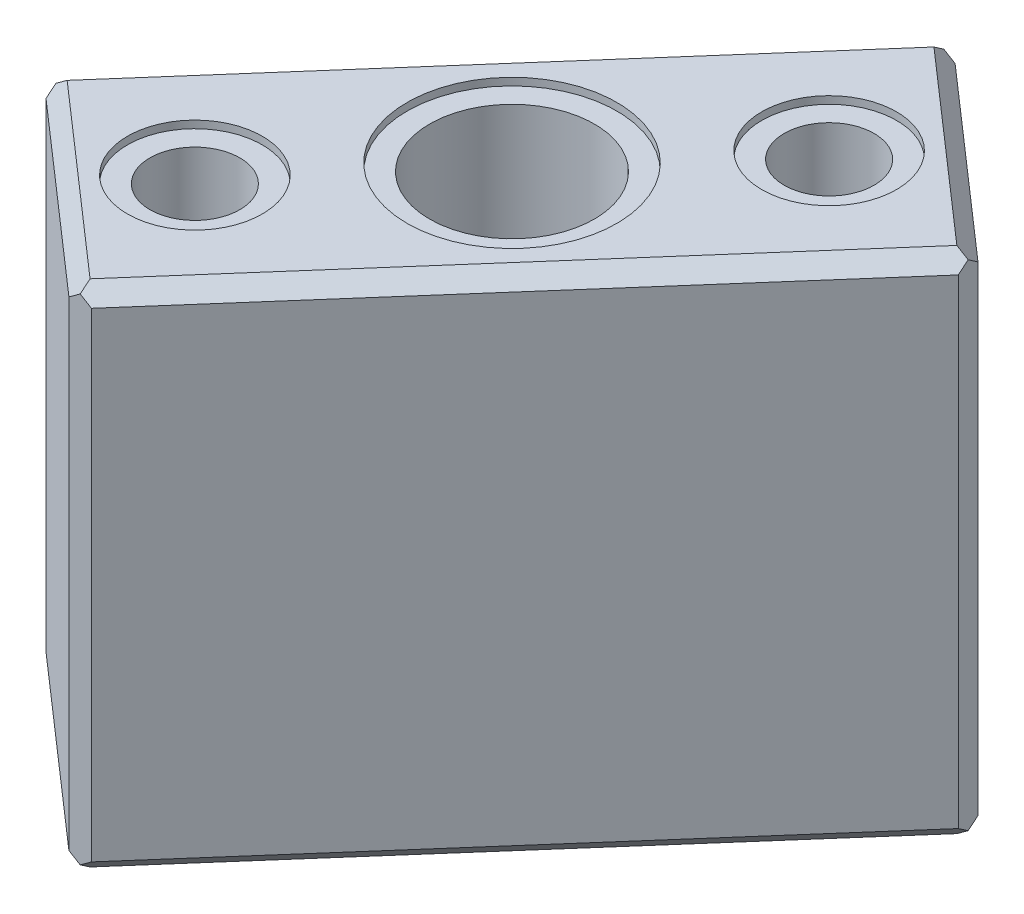
ISO-10303-21;
HEADER;
FILE_DESCRIPTION(('STEP AP214'),'2;1');
FILE_NAME('part.step','',(''),(''),'','','');
FILE_SCHEMA(('AUTOMOTIVE_DESIGN { 1 0 10303 214 1 1 1 1 }'));
ENDSEC;
DATA;
#1=APPLICATION_CONTEXT('core data for automotive mechanical design processes');
#2=APPLICATION_PROTOCOL_DEFINITION('international standard','automotive_design',2000,#1);
#3=PRODUCT_CONTEXT('',#1,'mechanical');
#4=PRODUCT('Part','Part','',(#3));
#5=PRODUCT_RELATED_PRODUCT_CATEGORY('part','',(#4));
#6=PRODUCT_DEFINITION_FORMATION('','',#4);
#7=PRODUCT_DEFINITION_CONTEXT('part definition',#1,'design');
#8=PRODUCT_DEFINITION('design','',#6,#7);
#9=PRODUCT_DEFINITION_SHAPE('','',#8);
#10=(LENGTH_UNIT() NAMED_UNIT(*) SI_UNIT(.MILLI.,.METRE.));
#11=(NAMED_UNIT(*) PLANE_ANGLE_UNIT() SI_UNIT($,.RADIAN.));
#12=(NAMED_UNIT(*) SI_UNIT($,.STERADIAN.) SOLID_ANGLE_UNIT());
#13=UNCERTAINTY_MEASURE_WITH_UNIT(LENGTH_MEASURE(1.E-05),#10,'distance_accuracy_value','');
#14=(GEOMETRIC_REPRESENTATION_CONTEXT(3) GLOBAL_UNCERTAINTY_ASSIGNED_CONTEXT((#13)) GLOBAL_UNIT_ASSIGNED_CONTEXT((#10,
#11,#12)) REPRESENTATION_CONTEXT('',''));
#15=CARTESIAN_POINT('',(0.,0.,0.));
#16=DIRECTION('',(0.,0.,1.));
#17=DIRECTION('',(1.,0.,0.));
#18=AXIS2_PLACEMENT_3D('',#15,#16,#17);
#19=CARTESIAN_POINT('',(-110.30475898659,-18.4999999999996,92.6101585459169));
#20=DIRECTION('',(0.,-1.,0.));
#21=DIRECTION('',(-0.625050923025958,0.,0.780583976023335));
#22=AXIS2_PLACEMENT_3D('',#19,#20,#21);
#23=PLANE('',#22);
#24=DIRECTION('',(0.658504607868521,0.,-0.752576694706875));
#25=VECTOR('',#24,1.);
#26=CARTESIAN_POINT('',(-108.909249657567,-18.4999999999996,93.8312292088123));
#27=LINE('',#26,#25);
#28=CARTESIAN_POINT('',(-125.536491006247,-18.4999999999995,112.833790750161));
#29=VERTEX_POINT('',#28);
#30=CARTESIAN_POINT('',(-112.037146544942,-18.4999999999996,97.4059685086701));
#31=VERTEX_POINT('',#30);
#32=EDGE_CURVE('E326',#29,#31,#27,.T.);
#33=ORIENTED_EDGE('',*,*,#32,.T.);
#34=DIRECTION('',(0.752576694706874,0.,0.658504607868522));
#35=VECTOR('',#34,1.);
#36=CARTESIAN_POINT('',(-113.432655873965,-18.4999999999996,96.1848978457747));
#37=LINE('',#36,#35);
#38=CARTESIAN_POINT('',(-105.919568803513,-18.4999999999996,102.758849032421));
#39=VERTEX_POINT('',#38);
#40=EDGE_CURVE('E329',#31,#39,#37,.T.);
#41=ORIENTED_EDGE('',*,*,#40,.T.);
#42=DIRECTION('',(-0.658504607868522,0.,0.752576694706875));
#43=VECTOR('',#42,1.);
#44=CARTESIAN_POINT('',(-102.791671916137,-18.4999999999996,99.1841097325633));
#45=LINE('',#44,#43);
#46=CARTESIAN_POINT('',(-119.418913264817,-18.4999999999995,118.186671273912));
#47=VERTEX_POINT('',#46);
#48=EDGE_CURVE('E287',#39,#47,#45,.T.);
#49=ORIENTED_EDGE('',*,*,#48,.T.);
#50=DIRECTION('',(-0.752576694706874,0.,-0.658504607868522));
#51=VECTOR('',#50,1.);
#52=CARTESIAN_POINT('',(-126.93200033527,-18.4999999999995,111.612720087266));
#53=LINE('',#52,#51);
#54=EDGE_CURVE('E323',#47,#29,#53,.T.);
#55=ORIENTED_EDGE('',*,*,#54,.T.);
#56=EDGE_LOOP('',(#33,#41,#49,#55));
#57=FACE_BOUND('',#56,.T.);
#58=ADVANCED_FACE('F158',(#57),#23,.T.);
#59=CARTESIAN_POINT('',(0.,-1.5,0.));
#60=DIRECTION('',(0.,1.,0.));
#61=DIRECTION('',(0.,0.,1.));
#62=AXIS2_PLACEMENT_3D('',#59,#60,#61);
#63=PLANE('',#62);
#64=CARTESIAN_POINT('',(-115.72802990488,-1.5,107.796319891291));
#65=DIRECTION('',(0.,1.,0.));
#66=DIRECTION('',(0.,0.,1.));
#67=AXIS2_PLACEMENT_3D('',#64,#65,#66);
#68=CIRCLE('',#67,3.50000000000001);
#69=CARTESIAN_POINT('',(-115.72802990488,-1.5,111.296319891291));
#70=VERTEX_POINT('',#69);
#71=EDGE_CURVE('E449',#70,#70,#68,.T.);
#72=ORIENTED_EDGE('',*,*,#71,.F.);
#73=EDGE_LOOP('',(#72));
#74=FACE_BOUND('',#73,.T.);
#75=CARTESIAN_POINT('',(-120.666814463894,-1.5,113.440645101593));
#76=DIRECTION('',(0.,1.,0.));
#77=DIRECTION('',(0.,0.,1.));
#78=AXIS2_PLACEMENT_3D('',#75,#76,#77);
#79=CIRCLE('',#78,2.25);
#80=CARTESIAN_POINT('',(-120.666814463894,-1.5,115.690645101593));
#81=VERTEX_POINT('',#80);
#82=EDGE_CURVE('E436',#81,#81,#79,.T.);
#83=ORIENTED_EDGE('',*,*,#82,.F.);
#84=EDGE_LOOP('',(#83));
#85=FACE_BOUND('',#84,.T.);
#86=CARTESIAN_POINT('',(-110.789245345866,-1.5,102.151994680989));
#87=DIRECTION('',(0.,1.,0.));
#88=DIRECTION('',(0.,0.,1.));
#89=AXIS2_PLACEMENT_3D('',#86,#87,#88);
#90=CIRCLE('',#89,2.25);
#91=CARTESIAN_POINT('',(-110.789245345866,-1.5,104.401994680989));
#92=VERTEX_POINT('',#91);
#93=EDGE_CURVE('E457',#92,#92,#90,.T.);
#94=ORIENTED_EDGE('',*,*,#93,.F.);
#95=EDGE_LOOP('',(#94));
#96=FACE_BOUND('',#95,.T.);
#97=DIRECTION('',(0.658504607868522,0.,-0.752576694706875));
#98=VECTOR('',#97,1.);
#99=CARTESIAN_POINT('',(-9.06510493459425,-1.5,-7.93196681777005));
#100=LINE('',#99,#98);
#101=CARTESIAN_POINT('',(-119.418913264817,-1.5,118.186671273912));
#102=VERTEX_POINT('',#101);
#103=CARTESIAN_POINT('',(-105.919568803513,-1.5,102.758849032421));
#104=VERTEX_POINT('',#103);
#105=EDGE_CURVE('E387',#102,#104,#100,.T.);
#106=ORIENTED_EDGE('',*,*,#105,.T.);
#107=DIRECTION('',(-0.752576694706874,0.,-0.658504607868522));
#108=VECTOR('',#107,1.);
#109=CARTESIAN_POINT('',(-96.8544638689183,-1.5,110.690815850191));
#110=LINE('',#109,#108);
#111=CARTESIAN_POINT('',(-112.037146544942,-1.5,97.4059685086701));
#112=VERTEX_POINT('',#111);
#113=EDGE_CURVE('E126',#104,#112,#110,.T.);
#114=ORIENTED_EDGE('',*,*,#113,.T.);
#115=DIRECTION('',(-0.658504607868521,0.,0.752576694706875));
#116=VECTOR('',#115,1.);
#117=CARTESIAN_POINT('',(-15.182682676024,-1.5,-13.2848473415211));
#118=LINE('',#117,#116);
#119=CARTESIAN_POINT('',(-125.536491006247,-1.5,112.833790750161));
#120=VERTEX_POINT('',#119);
#121=EDGE_CURVE('E169',#112,#120,#118,.T.);
#122=ORIENTED_EDGE('',*,*,#121,.T.);
#123=DIRECTION('',(0.752576694706874,0.,0.658504607868522));
#124=VECTOR('',#123,1.);
#125=CARTESIAN_POINT('',(-110.353808330223,-1.5,126.118638091682));
#126=LINE('',#125,#124);
#127=EDGE_CURVE('E390',#120,#102,#126,.T.);
#128=ORIENTED_EDGE('',*,*,#127,.T.);
#129=EDGE_LOOP('',(#106,#114,#122,#128));
#130=FACE_BOUND('',#129,.T.);
#131=ADVANCED_FACE('F531',(#74,#85,#96,#130),#63,.T.);
#132=CARTESIAN_POINT('',(-110.683060634157,-50.5720822243419,126.494926439035));
#133=DIRECTION('',(-0.658504607868522,0.,0.752576694706874));
#134=DIRECTION('',(0.752576694706874,0.,0.658504607868522));
#135=AXIS2_PLACEMENT_3D('',#132,#133,#134);
#136=PLANE('',#135);
#137=DIRECTION('',(0.,-1.,0.));
#138=VECTOR('',#137,1.);
#139=CARTESIAN_POINT('',(-125.865743310181,-50.5720822243419,113.210079097514));
#140=LINE('',#139,#138);
#141=CARTESIAN_POINT('',(-125.865743310181,-1.99999999999999,113.210079097514));
#142=VERTEX_POINT('',#141);
#143=CARTESIAN_POINT('',(-125.865743310181,-17.9999999999995,113.210079097514));
#144=VERTEX_POINT('',#143);
#145=EDGE_CURVE('E409',#142,#144,#140,.T.);
#146=ORIENTED_EDGE('',*,*,#145,.T.);
#147=DIRECTION('',(0.752576694706874,0.,0.658504607868522));
#148=VECTOR('',#147,1.);
#149=CARTESIAN_POINT('',(-110.683060634157,-17.9999999999995,126.494926439035));
#150=LINE('',#149,#148);
#151=CARTESIAN_POINT('',(-119.748165568751,-17.9999999999995,118.562959621265));
#152=VERTEX_POINT('',#151);
#153=EDGE_CURVE('E366',#144,#152,#150,.T.);
#154=ORIENTED_EDGE('',*,*,#153,.T.);
#155=DIRECTION('',(0.,1.,0.));
#156=VECTOR('',#155,1.);
#157=CARTESIAN_POINT('',(-119.748165568751,-50.5720822243419,118.562959621265));
#158=LINE('',#157,#156);
#159=CARTESIAN_POINT('',(-119.748165568751,-1.99999999999999,118.562959621265));
#160=VERTEX_POINT('',#159);
#161=EDGE_CURVE('E470',#152,#160,#158,.T.);
#162=ORIENTED_EDGE('',*,*,#161,.T.);
#163=DIRECTION('',(-0.752576694706874,0.,-0.658504607868522));
#164=VECTOR('',#163,1.);
#165=CARTESIAN_POINT('',(-110.683060634157,-1.99999999999999,126.494926439035));
#166=LINE('',#165,#164);
#167=EDGE_CURVE('E363',#160,#142,#166,.T.);
#168=ORIENTED_EDGE('',*,*,#167,.T.);
#169=EDGE_LOOP('',(#146,#154,#162,#168));
#170=FACE_BOUND('',#169,.T.);
#171=ADVANCED_FACE('F515',(#170),#136,.T.);
#172=CARTESIAN_POINT('',(-8.68881658724085,-50.5720822243419,-7.60271451383582));
#173=DIRECTION('',(0.752576694706874,0.,0.658504607868522));
#174=DIRECTION('',(0.658504607868522,0.,-0.752576694706875));
#175=AXIS2_PLACEMENT_3D('',#172,#173,#174);
#176=PLANE('',#175);
#177=DIRECTION('',(0.,-1.,0.));
#178=VECTOR('',#177,1.);
#179=CARTESIAN_POINT('',(-119.042624917464,-50.5720822243419,118.515923577846));
#180=LINE('',#179,#178);
#181=CARTESIAN_POINT('',(-119.042624917464,-1.99999999999996,118.515923577846));
#182=VERTEX_POINT('',#181);
#183=CARTESIAN_POINT('',(-119.042624917464,-17.9999999999996,118.515923577846));
#184=VERTEX_POINT('',#183);
#185=EDGE_CURVE('E478',#182,#184,#180,.T.);
#186=ORIENTED_EDGE('',*,*,#185,.T.);
#187=DIRECTION('',(0.658504607868522,0.,-0.752576694706875));
#188=VECTOR('',#187,1.);
#189=CARTESIAN_POINT('',(-8.68881658724077,-18.0000000000001,-7.6027145138359));
#190=LINE('',#189,#188);
#191=CARTESIAN_POINT('',(-105.543280456159,-17.9999999999996,103.088101336355));
#192=VERTEX_POINT('',#191);
#193=EDGE_CURVE('E384',#184,#192,#190,.T.);
#194=ORIENTED_EDGE('',*,*,#193,.T.);
#195=DIRECTION('',(0.,1.,0.));
#196=VECTOR('',#195,1.);
#197=CARTESIAN_POINT('',(-105.543280456159,-50.5720822243419,103.088101336355));
#198=LINE('',#197,#196);
#199=CARTESIAN_POINT('',(-105.543280456159,-1.99999999999996,103.088101336355));
#200=VERTEX_POINT('',#199);
#201=EDGE_CURVE('E474',#192,#200,#198,.T.);
#202=ORIENTED_EDGE('',*,*,#201,.T.);
#203=DIRECTION('',(-0.658504607868522,0.,0.752576694706875));
#204=VECTOR('',#203,1.);
#205=CARTESIAN_POINT('',(-8.68881658724085,-1.99999999999996,-7.60271451383582));
#206=LINE('',#205,#204);
#207=EDGE_CURVE('E381',#200,#182,#206,.T.);
#208=ORIENTED_EDGE('',*,*,#207,.T.);
#209=EDGE_LOOP('',(#186,#194,#202,#208));
#210=FACE_BOUND('',#209,.T.);
#211=ADVANCED_FACE('F546',(#210),#176,.T.);
#212=CARTESIAN_POINT('',(-96.525211564984,-50.5720822243419,110.314527502838));
#213=DIRECTION('',(0.658504607868522,0.,-0.752576694706874));
#214=DIRECTION('',(-0.752576694706874,0.,-0.658504607868522));
#215=AXIS2_PLACEMENT_3D('',#212,#213,#214);
#216=PLANE('',#215);
#217=DIRECTION('',(0.,-1.,0.));
#218=VECTOR('',#217,1.);
#219=CARTESIAN_POINT('',(-105.590316499578,-50.5720822243419,102.382560685068));
#220=LINE('',#219,#218);
#221=CARTESIAN_POINT('',(-105.590316499578,-1.99999999999999,102.382560685068));
#222=VERTEX_POINT('',#221);
#223=CARTESIAN_POINT('',(-105.590316499578,-17.9999999999996,102.382560685068));
#224=VERTEX_POINT('',#223);
#225=EDGE_CURVE('E298',#222,#224,#220,.T.);
#226=ORIENTED_EDGE('',*,*,#225,.T.);
#227=DIRECTION('',(-0.752576694706874,0.,-0.658504607868522));
#228=VECTOR('',#227,1.);
#229=CARTESIAN_POINT('',(-96.525211564984,-17.9999999999996,110.314527502838));
#230=LINE('',#229,#228);
#231=CARTESIAN_POINT('',(-111.707894241008,-17.9999999999996,97.0296801613166));
#232=VERTEX_POINT('',#231);
#233=EDGE_CURVE('E279',#224,#232,#230,.T.);
#234=ORIENTED_EDGE('',*,*,#233,.T.);
#235=DIRECTION('',(0.,1.,0.));
#236=VECTOR('',#235,1.);
#237=CARTESIAN_POINT('',(-111.707894241008,-50.5720822243419,97.0296801613166));
#238=LINE('',#237,#236);
#239=CARTESIAN_POINT('',(-111.707894241008,-1.99999999999999,97.0296801613166));
#240=VERTEX_POINT('',#239);
#241=EDGE_CURVE('E295',#232,#240,#238,.T.);
#242=ORIENTED_EDGE('',*,*,#241,.T.);
#243=DIRECTION('',(0.752576694706874,0.,0.658504607868522));
#244=VECTOR('',#243,1.);
#245=CARTESIAN_POINT('',(-96.525211564984,-1.99999999999999,110.314527502838));
#246=LINE('',#245,#244);
#247=EDGE_CURVE('E301',#240,#222,#246,.T.);
#248=ORIENTED_EDGE('',*,*,#247,.T.);
#249=EDGE_LOOP('',(#226,#234,#242,#248));
#250=FACE_BOUND('',#249,.T.);
#251=ADVANCED_FACE('F293',(#250),#216,.T.);
#252=CARTESIAN_POINT('',(-15.5589710233774,-50.5720822243419,-13.6140996454554));
#253=DIRECTION('',(-0.752576694706875,0.,-0.658504607868521));
#254=DIRECTION('',(-0.658504607868521,0.,0.752576694706875));
#255=AXIS2_PLACEMENT_3D('',#252,#253,#254);
#256=PLANE('',#255);
#257=DIRECTION('',(0.,-1.,0.));
#258=VECTOR('',#257,1.);
#259=CARTESIAN_POINT('',(-112.413434892296,-50.5720822243419,97.0767162047358));
#260=LINE('',#259,#258);
#261=CARTESIAN_POINT('',(-112.413434892296,-1.99999999999998,97.0767162047358));
#262=VERTEX_POINT('',#261);
#263=CARTESIAN_POINT('',(-112.413434892296,-17.9999999999996,97.0767162047358));
#264=VERTEX_POINT('',#263);
#265=EDGE_CURVE('E482',#262,#264,#260,.T.);
#266=ORIENTED_EDGE('',*,*,#265,.T.);
#267=DIRECTION('',(-0.658504607868521,0.,0.752576694706875));
#268=VECTOR('',#267,1.);
#269=CARTESIAN_POINT('',(-15.5589710233773,-18.0000000000001,-13.6140996454554));
#270=LINE('',#269,#268);
#271=CARTESIAN_POINT('',(-125.9127793536,-17.9999999999996,112.504538446227));
#272=VERTEX_POINT('',#271);
#273=EDGE_CURVE('E348',#264,#272,#270,.T.);
#274=ORIENTED_EDGE('',*,*,#273,.T.);
#275=DIRECTION('',(0.,1.,0.));
#276=VECTOR('',#275,1.);
#277=CARTESIAN_POINT('',(-125.9127793536,-50.5720822243419,112.504538446227));
#278=LINE('',#277,#276);
#279=CARTESIAN_POINT('',(-125.9127793536,-1.99999999999998,112.504538446227));
#280=VERTEX_POINT('',#279);
#281=EDGE_CURVE('E311',#272,#280,#278,.T.);
#282=ORIENTED_EDGE('',*,*,#281,.T.);
#283=DIRECTION('',(0.658504607868521,0.,-0.752576694706875));
#284=VECTOR('',#283,1.);
#285=CARTESIAN_POINT('',(-15.5589710233774,-1.99999999999998,-13.6140996454554));
#286=LINE('',#285,#284);
#287=EDGE_CURVE('E345',#280,#262,#286,.T.);
#288=ORIENTED_EDGE('',*,*,#287,.T.);
#289=EDGE_LOOP('',(#266,#274,#282,#288));
#290=FACE_BOUND('',#289,.T.);
#291=ADVANCED_FACE('F491',(#290),#256,.T.);
#292=CARTESIAN_POINT('',(-119.748165568751,-50.5720822243419,118.562959621265));
#293=DIRECTION('',(-0.0665190105238208,0.,-0.997785157856606));
#294=DIRECTION('',(0.,1.,0.));
#295=AXIS2_PLACEMENT_3D('',#292,#293,#294);
#296=PLANE('',#295);
#297=ORIENTED_EDGE('',*,*,#161,.F.);
#298=DIRECTION('',(0.814688169890332,-0.577350269189651,-0.0543125446593939));
#299=VECTOR('',#298,1.);
#300=CARTESIAN_POINT('',(-104.427546831179,-28.8573607414479,117.54158503876));
#301=LINE('',#300,#299);
#302=CARTESIAN_POINT('',(-119.395395243108,-18.2499999999995,118.539441599556));
#303=VERTEX_POINT('',#302);
#304=EDGE_CURVE('E378',#152,#303,#301,.T.);
#305=ORIENTED_EDGE('',*,*,#304,.T.);
#306=DIRECTION('',(0.814688169890375,0.57735026918959,-0.0543125446593968));
#307=VECTOR('',#306,1.);
#308=CARTESIAN_POINT('',(-134.833604089228,-29.190694074779,119.568655522631));
#309=LINE('',#308,#307);
#310=EDGE_CURVE('E375',#303,#184,#309,.T.);
#311=ORIENTED_EDGE('',*,*,#310,.T.);
#312=ORIENTED_EDGE('',*,*,#185,.F.);
#313=DIRECTION('',(-0.814688169890364,0.577350269189606,0.054312544659396));
#314=VECTOR('',#313,1.);
#315=CARTESIAN_POINT('',(-96.6665996670149,-17.8573607414462,117.024188561149));
#316=LINE('',#315,#314);
#317=CARTESIAN_POINT('',(-119.395395243108,-1.74999999999998,118.539441599556));
#318=VERTEX_POINT('',#317);
#319=EDGE_CURVE('E369',#182,#318,#316,.T.);
#320=ORIENTED_EDGE('',*,*,#319,.T.);
#321=DIRECTION('',(-0.814688169890336,-0.577350269189646,0.0543125446593942));
#322=VECTOR('',#321,1.);
#323=CARTESIAN_POINT('',(-142.594551253393,-18.1906940747818,120.086052000243));
#324=LINE('',#323,#322);
#325=EDGE_CURVE('E372',#318,#160,#324,.T.);
#326=ORIENTED_EDGE('',*,*,#325,.T.);
#327=EDGE_LOOP('',(#297,#305,#311,#312,#320,#326));
#328=FACE_BOUND('',#327,.T.);
#329=ADVANCED_FACE('F518',(#328),#296,.F.);
#330=CARTESIAN_POINT('',(-125.9127793536,-50.5720822243419,112.504538446227));
#331=DIRECTION('',(0.997785157856611,0.,-0.0665190105237388));
#332=DIRECTION('',(0.,1.,0.));
#333=AXIS2_PLACEMENT_3D('',#330,#331,#332);
#334=PLANE('',#333);
#335=ORIENTED_EDGE('',*,*,#281,.F.);
#336=DIRECTION('',(0.0543125446593289,-0.577350269189609,0.814688169890366));
#337=VECTOR('',#336,1.);
#338=CARTESIAN_POINT('',(-124.891404771096,-28.8573607414464,127.825157183799));
#339=LINE('',#338,#337);
#340=CARTESIAN_POINT('',(-125.889261331891,-18.2499999999995,112.857308771871));
#341=VERTEX_POINT('',#340);
#342=EDGE_CURVE('E360',#272,#341,#339,.T.);
#343=ORIENTED_EDGE('',*,*,#342,.T.);
#344=DIRECTION('',(0.0543125446593273,0.577350269189643,0.814688169890343));
#345=VECTOR('',#344,1.);
#346=CARTESIAN_POINT('',(-126.918475254965,-29.190694074781,97.4190999257498));
#347=LINE('',#346,#345);
#348=EDGE_CURVE('E357',#341,#144,#347,.T.);
#349=ORIENTED_EDGE('',*,*,#348,.T.);
#350=ORIENTED_EDGE('',*,*,#145,.F.);
#351=DIRECTION('',(-0.0543125446593276,0.577350269189637,-0.814688169890346));
#352=VECTOR('',#351,1.);
#353=CARTESIAN_POINT('',(-124.374008293485,-17.8573607414479,135.586104347964));
#354=LINE('',#353,#352);
#355=CARTESIAN_POINT('',(-125.889261331891,-1.74999999999999,112.857308771871));
#356=VERTEX_POINT('',#355);
#357=EDGE_CURVE('E351',#142,#356,#354,.T.);
#358=ORIENTED_EDGE('',*,*,#357,.T.);
#359=DIRECTION('',(-0.0543125446593281,-0.577350269189626,-0.814688169890355));
#360=VECTOR('',#359,1.);
#361=CARTESIAN_POINT('',(-127.435871732576,-18.1906940747806,89.6581527615855));
#362=LINE('',#361,#360);
#363=EDGE_CURVE('E354',#356,#280,#362,.T.);
#364=ORIENTED_EDGE('',*,*,#363,.T.);
#365=EDGE_LOOP('',(#335,#343,#349,#350,#358,#364));
#366=FACE_BOUND('',#365,.T.);
#367=ADVANCED_FACE('F505',(#366),#334,.F.);
#368=CARTESIAN_POINT('',(-111.707894241008,-50.5720822243419,97.0296801613166));
#369=DIRECTION('',(0.0665190105238026,0.,0.997785157856607));
#370=DIRECTION('',(0.,1.,0.));
#371=AXIS2_PLACEMENT_3D('',#368,#369,#370);
#372=PLANE('',#371);
#373=ORIENTED_EDGE('',*,*,#241,.F.);
#374=DIRECTION('',(-0.81468816989034,-0.577350269189642,0.0543125446593795));
#375=VECTOR('',#374,1.);
#376=CARTESIAN_POINT('',(-127.028512978581,-28.8573607414476,98.051054743822));
#377=LINE('',#376,#375);
#378=CARTESIAN_POINT('',(-112.060664566652,-18.2499999999996,97.0531981830262));
#379=VERTEX_POINT('',#378);
#380=EDGE_CURVE('E275',#232,#379,#377,.T.);
#381=ORIENTED_EDGE('',*,*,#380,.T.);
#382=DIRECTION('',(-0.814688169890362,0.577350269189611,0.054312544659381));
#383=VECTOR('',#382,1.);
#384=CARTESIAN_POINT('',(-96.6224557205314,-29.1906940747798,96.0239842599511));
#385=LINE('',#384,#383);
#386=EDGE_CURVE('E288',#379,#264,#385,.T.);
#387=ORIENTED_EDGE('',*,*,#386,.T.);
#388=ORIENTED_EDGE('',*,*,#265,.F.);
#389=DIRECTION('',(0.814688169890352,0.577350269189625,-0.0543125446593803));
#390=VECTOR('',#389,1.);
#391=CARTESIAN_POINT('',(-134.789460142745,-17.8573607414472,98.5684512214331));
#392=LINE('',#391,#390);
#393=CARTESIAN_POINT('',(-112.060664566652,-1.75000000000002,97.0531981830262));
#394=VERTEX_POINT('',#393);
#395=EDGE_CURVE('E300',#262,#394,#392,.T.);
#396=ORIENTED_EDGE('',*,*,#395,.T.);
#397=DIRECTION('',(0.814688169890353,-0.577350269189622,-0.0543125446593805));
#398=VECTOR('',#397,1.);
#399=CARTESIAN_POINT('',(-88.8615085563668,-18.1906940747804,95.5065877823399));
#400=LINE('',#399,#398);
#401=EDGE_CURVE('E304',#394,#240,#400,.T.);
#402=ORIENTED_EDGE('',*,*,#401,.T.);
#403=EDGE_LOOP('',(#373,#381,#387,#388,#396,#402));
#404=FACE_BOUND('',#403,.T.);
#405=ADVANCED_FACE('F303',(#404),#372,.F.);
#406=CARTESIAN_POINT('',(-105.543280456159,-50.5720822243419,103.088101336355));
#407=DIRECTION('',(-0.997785157856607,0.,0.0665190105238));
#408=DIRECTION('',(0.,1.,0.));
#409=AXIS2_PLACEMENT_3D('',#406,#407,#408);
#410=PLANE('',#409);
#411=DIRECTION('',(-0.0543125446593782,-0.577350269189625,-0.814688169890352));
#412=VECTOR('',#411,1.);
#413=CARTESIAN_POINT('',(-106.564655038664,-28.857360741447,87.7674825987828));
#414=LINE('',#413,#412);
#415=CARTESIAN_POINT('',(-105.566798477869,-18.2499999999996,102.735331010712));
#416=VERTEX_POINT('',#415);
#417=EDGE_CURVE('E339',#192,#416,#414,.T.);
#418=ORIENTED_EDGE('',*,*,#417,.T.);
#419=DIRECTION('',(-0.0543125446593786,0.577350269189616,-0.814688169890358));
#420=VECTOR('',#419,1.);
#421=CARTESIAN_POINT('',(-104.537584554794,-29.19069407478,118.173539856832));
#422=LINE('',#421,#420);
#423=EDGE_CURVE('E342',#416,#224,#422,.T.);
#424=ORIENTED_EDGE('',*,*,#423,.T.);
#425=ORIENTED_EDGE('',*,*,#225,.F.);
#426=DIRECTION('',(0.0543125446593794,0.577350269189597,0.814688169890372));
#427=VECTOR('',#426,1.);
#428=CARTESIAN_POINT('',(-107.082051516275,-17.8573607414457,80.0065354346188));
#429=LINE('',#428,#427);
#430=CARTESIAN_POINT('',(-105.566798477869,-1.75,102.735331010711));
#431=VERTEX_POINT('',#430);
#432=EDGE_CURVE('E336',#222,#431,#429,.T.);
#433=ORIENTED_EDGE('',*,*,#432,.T.);
#434=DIRECTION('',(0.0543125446593775,-0.577350269189638,0.814688169890342));
#435=VECTOR('',#434,1.);
#436=CARTESIAN_POINT('',(-104.020188077182,-18.1906940747813,125.934487020997));
#437=LINE('',#436,#435);
#438=EDGE_CURVE('E333',#431,#200,#437,.T.);
#439=ORIENTED_EDGE('',*,*,#438,.T.);
#440=ORIENTED_EDGE('',*,*,#201,.F.);
#441=EDGE_LOOP('',(#418,#424,#425,#433,#439,#440));
#442=FACE_BOUND('',#441,.T.);
#443=ADVANCED_FACE('F535',(#442),#410,.F.);
#444=CARTESIAN_POINT('',(-110.683060634157,-17.9999999999995,126.494926439035));
#445=DIRECTION('',(0.465633073666424,0.707106781186543,-0.532152084190193));
#446=DIRECTION('',(0.752576694706874,0.,0.658504607868522));
#447=AXIS2_PLACEMENT_3D('',#444,#445,#446);
#448=PLANE('',#447);
#449=DIRECTION('',(-0.814688169890352,0.577350269189628,0.0543125446593445));
#450=VECTOR('',#449,1.);
#451=CARTESIAN_POINT('',(-47.1827026331376,-74.02747969242,107.610204858622));
#452=LINE('',#451,#450);
#453=EDGE_CURVE('E401',#29,#341,#452,.T.);
#454=ORIENTED_EDGE('',*,*,#453,.F.);
#455=ORIENTED_EDGE('',*,*,#54,.F.);
#456=DIRECTION('',(0.0543125446593722,0.577350269189622,0.814688169890354));
#457=VECTOR('',#456,1.);
#458=CARTESIAN_POINT('',(-119.00984319693,-14.1515255307295,124.322722292225));
#459=LINE('',#458,#457);
#460=EDGE_CURVE('E405',#303,#47,#459,.F.);
#461=ORIENTED_EDGE('',*,*,#460,.F.);
#462=ORIENTED_EDGE('',*,*,#304,.F.);
#463=ORIENTED_EDGE('',*,*,#153,.F.);
#464=ORIENTED_EDGE('',*,*,#348,.F.);
#465=EDGE_LOOP('',(#454,#455,#461,#462,#463,#464));
#466=FACE_BOUND('',#465,.T.);
#467=ADVANCED_FACE('F509',(#466),#448,.F.);
#468=CARTESIAN_POINT('',(-8.68881658724077,-18.0000000000001,-7.6027145138359));
#469=DIRECTION('',(-0.532152084190178,0.707106781186561,-0.465633073666413));
#470=DIRECTION('',(0.658504607868522,0.,-0.752576694706875));
#471=AXIS2_PLACEMENT_3D('',#468,#469,#470);
#472=PLANE('',#471);
#473=ORIENTED_EDGE('',*,*,#460,.T.);
#474=ORIENTED_EDGE('',*,*,#48,.F.);
#475=DIRECTION('',(0.814688169890359,0.57735026918962,-0.0543125446593333));
#476=VECTOR('',#475,1.);
#477=CARTESIAN_POINT('',(-36.2674484629519,30.8608130257529,98.1153743430524));
#478=LINE('',#477,#476);
#479=EDGE_CURVE('E397',#416,#39,#478,.F.);
#480=ORIENTED_EDGE('',*,*,#479,.F.);
#481=ORIENTED_EDGE('',*,*,#417,.F.);
#482=ORIENTED_EDGE('',*,*,#193,.F.);
#483=ORIENTED_EDGE('',*,*,#310,.F.);
#484=EDGE_LOOP('',(#473,#474,#480,#481,#482,#483));
#485=FACE_BOUND('',#484,.T.);
#486=ADVANCED_FACE('F541',(#485),#472,.F.);
#487=CARTESIAN_POINT('',(-15.5589710233773,-18.0000000000001,-13.6140996454554));
#488=DIRECTION('',(0.532152084190188,0.707106781186551,0.465633073666416));
#489=DIRECTION('',(-0.658504607868521,0.,0.752576694706875));
#490=AXIS2_PLACEMENT_3D('',#487,#488,#489);
#491=PLANE('',#490);
#492=ORIENTED_EDGE('',*,*,#273,.F.);
#493=ORIENTED_EDGE('',*,*,#386,.F.);
#494=DIRECTION('',(-0.0543125446593611,0.577350269189624,-0.814688169890353));
#495=VECTOR('',#494,1.);
#496=CARTESIAN_POINT('',(-111.435892129054,-24.8914221114419,106.424784746993));
#497=LINE('',#496,#495);
#498=EDGE_CURVE('E282',#31,#379,#497,.T.);
#499=ORIENTED_EDGE('',*,*,#498,.F.);
#500=ORIENTED_EDGE('',*,*,#32,.F.);
#501=ORIENTED_EDGE('',*,*,#453,.T.);
#502=ORIENTED_EDGE('',*,*,#342,.F.);
#503=EDGE_LOOP('',(#492,#493,#499,#500,#501,#502));
#504=FACE_BOUND('',#503,.T.);
#505=ADVANCED_FACE('F501',(#504),#491,.F.);
#506=CARTESIAN_POINT('',(-96.525211564984,-17.9999999999996,110.314527502838));
#507=DIRECTION('',(-0.465633073666422,0.707106781186545,0.532152084190191));
#508=DIRECTION('',(-0.752576694706874,0.,-0.658504607868522));
#509=AXIS2_PLACEMENT_3D('',#506,#507,#508);
#510=PLANE('',#509);
#511=ORIENTED_EDGE('',*,*,#479,.T.);
#512=ORIENTED_EDGE('',*,*,#40,.F.);
#513=ORIENTED_EDGE('',*,*,#498,.T.);
#514=ORIENTED_EDGE('',*,*,#380,.F.);
#515=ORIENTED_EDGE('',*,*,#233,.F.);
#516=ORIENTED_EDGE('',*,*,#423,.F.);
#517=EDGE_LOOP('',(#511,#512,#513,#514,#515,#516));
#518=FACE_BOUND('',#517,.T.);
#519=ADVANCED_FACE('F277',(#518),#510,.F.);
#520=CARTESIAN_POINT('',(-110.353808330223,-1.5,126.118638091682));
#521=DIRECTION('',(0.46563307366642,-0.707106781186547,-0.532152084190189));
#522=DIRECTION('',(0.752576694706874,0.,0.658504607868522));
#523=AXIS2_PLACEMENT_3D('',#520,#521,#522);
#524=PLANE('',#523);
#525=ORIENTED_EDGE('',*,*,#167,.F.);
#526=ORIENTED_EDGE('',*,*,#325,.F.);
#527=DIRECTION('',(0.0543125446593522,-0.577350269189626,0.814688169890353));
#528=VECTOR('',#527,1.);
#529=CARTESIAN_POINT('',(-124.673856518637,54.3608130257541,39.3625224666103));
#530=LINE('',#529,#528);
#531=EDGE_CURVE('E398',#102,#318,#530,.T.);
#532=ORIENTED_EDGE('',*,*,#531,.F.);
#533=ORIENTED_EDGE('',*,*,#127,.F.);
#534=DIRECTION('',(-0.814688169890348,-0.577350269189632,0.0543125446593646));
#535=VECTOR('',#534,1.);
#536=CARTESIAN_POINT('',(-116.047314333732,5.22475544477553,112.201178971993));
#537=LINE('',#536,#535);
#538=EDGE_CURVE('E417',#356,#120,#537,.F.);
#539=ORIENTED_EDGE('',*,*,#538,.F.);
#540=ORIENTED_EDGE('',*,*,#357,.F.);
#541=EDGE_LOOP('',(#525,#526,#532,#533,#539,#540));
#542=FACE_BOUND('',#541,.T.);
#543=ADVANCED_FACE('F161',(#542),#524,.F.);
#544=CARTESIAN_POINT('',(-9.06510493459427,-1.5,-7.93196681777007));
#545=DIRECTION('',(-0.532152084190189,-0.707106781186547,-0.46563307366642));
#546=DIRECTION('',(0.658504607868522,0.,-0.752576694706875));
#547=AXIS2_PLACEMENT_3D('',#544,#545,#546);
#548=PLANE('',#547);
#549=ORIENTED_EDGE('',*,*,#207,.F.);
#550=ORIENTED_EDGE('',*,*,#438,.F.);
#551=DIRECTION('',(0.814688169890357,-0.577350269189618,-0.0543125446593709));
#552=VECTOR('',#551,1.);
#553=CARTESIAN_POINT('',(-100.253878219391,-5.51514113593643,102.381136326813));
#554=LINE('',#553,#552);
#555=EDGE_CURVE('E412',#104,#431,#554,.T.);
#556=ORIENTED_EDGE('',*,*,#555,.F.);
#557=ORIENTED_EDGE('',*,*,#105,.F.);
#558=ORIENTED_EDGE('',*,*,#531,.T.);
#559=ORIENTED_EDGE('',*,*,#319,.F.);
#560=EDGE_LOOP('',(#549,#550,#556,#557,#558,#559));
#561=FACE_BOUND('',#560,.T.);
#562=ADVANCED_FACE('F528',(#561),#548,.F.);
#563=CARTESIAN_POINT('',(-15.182682676024,-1.5,-13.2848473415211));
#564=DIRECTION('',(0.532152084190197,-0.707106781186537,0.465633073666427));
#565=DIRECTION('',(-0.658504607868521,0.,0.752576694706875));
#566=AXIS2_PLACEMENT_3D('',#563,#564,#565);
#567=PLANE('',#566);
#568=ORIENTED_EDGE('',*,*,#538,.T.);
#569=ORIENTED_EDGE('',*,*,#121,.F.);
#570=DIRECTION('',(-0.054312544659323,-0.577350269189623,-0.814688169890357));
#571=VECTOR('',#570,1.);
#572=CARTESIAN_POINT('',(-116.649263872031,-50.5274796924224,28.2242086022972));
#573=LINE('',#572,#571);
#574=EDGE_CURVE('E177',#394,#112,#573,.F.);
#575=ORIENTED_EDGE('',*,*,#574,.F.);
#576=ORIENTED_EDGE('',*,*,#395,.F.);
#577=ORIENTED_EDGE('',*,*,#287,.F.);
#578=ORIENTED_EDGE('',*,*,#363,.F.);
#579=EDGE_LOOP('',(#568,#569,#575,#576,#577,#578));
#580=FACE_BOUND('',#579,.T.);
#581=ADVANCED_FACE('F499',(#580),#567,.F.);
#582=CARTESIAN_POINT('',(-96.8544638689183,-1.5,110.690815850191));
#583=DIRECTION('',(-0.46563307366641,-0.707106781186563,0.532152084190177));
#584=DIRECTION('',(-0.752576694706874,0.,-0.658504607868522));
#585=AXIS2_PLACEMENT_3D('',#582,#583,#584);
#586=PLANE('',#585);
#587=ORIENTED_EDGE('',*,*,#432,.F.);
#588=ORIENTED_EDGE('',*,*,#247,.F.);
#589=ORIENTED_EDGE('',*,*,#401,.F.);
#590=ORIENTED_EDGE('',*,*,#574,.T.);
#591=ORIENTED_EDGE('',*,*,#113,.F.);
#592=ORIENTED_EDGE('',*,*,#555,.T.);
#593=EDGE_LOOP('',(#587,#588,#589,#590,#591,#592));
#594=FACE_BOUND('',#593,.T.);
#595=ADVANCED_FACE('F533',(#594),#586,.F.);
#596=CARTESIAN_POINT('',(-110.789245345866,-1.75,102.151994680989));
#597=DIRECTION('',(0.,1.,0.));
#598=DIRECTION('',(0.,0.,1.));
#599=AXIS2_PLACEMENT_3D('',#596,#597,#598);
#600=CYLINDRICAL_SURFACE('',#599,2.25);
#601=CARTESIAN_POINT('',(-110.789245345866,-1.75,102.151994680989));
#602=DIRECTION('',(0.,1.,0.));
#603=DIRECTION('',(0.,0.,1.));
#604=AXIS2_PLACEMENT_3D('',#601,#602,#603);
#605=CIRCLE('',#604,2.25);
#606=CARTESIAN_POINT('',(-110.789245345866,-1.75,104.401994680989));
#607=VERTEX_POINT('',#606);
#608=EDGE_CURVE('E413',#607,#607,#605,.T.);
#609=ORIENTED_EDGE('',*,*,#608,.F.);
#610=EDGE_LOOP('',(#609));
#611=FACE_BOUND('',#610,.T.);
#612=ORIENTED_EDGE('',*,*,#93,.T.);
#613=EDGE_LOOP('',(#612));
#614=FACE_BOUND('',#613,.T.);
#615=ADVANCED_FACE('F609',(#611,#614),#600,.F.);
#616=CARTESIAN_POINT('',(-110.789245345866,-1.75,102.151994680989));
#617=DIRECTION('',(0.,1.,0.));
#618=DIRECTION('',(0.,0.,1.));
#619=AXIS2_PLACEMENT_3D('',#616,#617,#618);
#620=PLANE('',#619);
#621=CARTESIAN_POINT('',(-110.789245345866,-1.75,102.151994680989));
#622=DIRECTION('',(0.,1.,0.));
#623=DIRECTION('',(0.,0.,1.));
#624=AXIS2_PLACEMENT_3D('',#621,#622,#623);
#625=CIRCLE('',#624,1.5);
#626=CARTESIAN_POINT('',(-110.789245345866,-1.75,103.651994680989));
#627=VERTEX_POINT('',#626);
#628=EDGE_CURVE('E163',#627,#627,#625,.T.);
#629=ORIENTED_EDGE('',*,*,#628,.F.);
#630=EDGE_LOOP('',(#629));
#631=FACE_BOUND('',#630,.T.);
#632=ORIENTED_EDGE('',*,*,#608,.T.);
#633=EDGE_LOOP('',(#632));
#634=FACE_BOUND('',#633,.T.);
#635=ADVANCED_FACE('F761',(#631,#634),#620,.T.);
#636=CARTESIAN_POINT('',(-120.666814463894,-1.75,113.440645101593));
#637=DIRECTION('',(0.,1.,0.));
#638=DIRECTION('',(0.,0.,1.));
#639=AXIS2_PLACEMENT_3D('',#636,#637,#638);
#640=CYLINDRICAL_SURFACE('',#639,2.25);
#641=CARTESIAN_POINT('',(-120.666814463894,-1.75,113.440645101593));
#642=DIRECTION('',(0.,1.,0.));
#643=DIRECTION('',(0.,0.,1.));
#644=AXIS2_PLACEMENT_3D('',#641,#642,#643);
#645=CIRCLE('',#644,2.25);
#646=CARTESIAN_POINT('',(-120.666814463894,-1.75,115.690645101593));
#647=VERTEX_POINT('',#646);
#648=EDGE_CURVE('E442',#647,#647,#645,.T.);
#649=ORIENTED_EDGE('',*,*,#648,.F.);
#650=EDGE_LOOP('',(#649));
#651=FACE_BOUND('',#650,.T.);
#652=ORIENTED_EDGE('',*,*,#82,.T.);
#653=EDGE_LOOP('',(#652));
#654=FACE_BOUND('',#653,.T.);
#655=ADVANCED_FACE('F772',(#651,#654),#640,.F.);
#656=CARTESIAN_POINT('',(-120.666814463894,-1.75,113.440645101593));
#657=DIRECTION('',(0.,1.,0.));
#658=DIRECTION('',(0.,0.,1.));
#659=AXIS2_PLACEMENT_3D('',#656,#657,#658);
#660=PLANE('',#659);
#661=CARTESIAN_POINT('',(-120.666814463894,-1.75,113.440645101593));
#662=DIRECTION('',(0.,1.,0.));
#663=DIRECTION('',(0.,0.,1.));
#664=AXIS2_PLACEMENT_3D('',#661,#662,#663);
#665=CIRCLE('',#664,1.5);
#666=CARTESIAN_POINT('',(-120.666814463894,-1.75,114.940645101593));
#667=VERTEX_POINT('',#666);
#668=EDGE_CURVE('E427',#667,#667,#665,.T.);
#669=ORIENTED_EDGE('',*,*,#668,.F.);
#670=EDGE_LOOP('',(#669));
#671=FACE_BOUND('',#670,.T.);
#672=ORIENTED_EDGE('',*,*,#648,.T.);
#673=EDGE_LOOP('',(#672));
#674=FACE_BOUND('',#673,.T.);
#675=ADVANCED_FACE('F783',(#671,#674),#660,.T.);
#676=CARTESIAN_POINT('',(-115.72802990488,-1.75,107.796319891291));
#677=DIRECTION('',(0.,1.,0.));
#678=DIRECTION('',(0.,0.,1.));
#679=AXIS2_PLACEMENT_3D('',#676,#677,#678);
#680=CYLINDRICAL_SURFACE('',#679,3.50000000000001);
#681=CARTESIAN_POINT('',(-115.72802990488,-1.75,107.796319891291));
#682=DIRECTION('',(0.,1.,0.));
#683=DIRECTION('',(0.,0.,1.));
#684=AXIS2_PLACEMENT_3D('',#681,#682,#683);
#685=CIRCLE('',#684,3.50000000000001);
#686=CARTESIAN_POINT('',(-115.72802990488,-1.75,111.296319891291));
#687=VERTEX_POINT('',#686);
#688=EDGE_CURVE('E453',#687,#687,#685,.T.);
#689=ORIENTED_EDGE('',*,*,#688,.F.);
#690=EDGE_LOOP('',(#689));
#691=FACE_BOUND('',#690,.T.);
#692=ORIENTED_EDGE('',*,*,#71,.T.);
#693=EDGE_LOOP('',(#692));
#694=FACE_BOUND('',#693,.T.);
#695=ADVANCED_FACE('F792',(#691,#694),#680,.F.);
#696=CARTESIAN_POINT('',(-115.72802990488,-1.75,107.796319891291));
#697=DIRECTION('',(0.,1.,0.));
#698=DIRECTION('',(0.,0.,1.));
#699=AXIS2_PLACEMENT_3D('',#696,#697,#698);
#700=PLANE('',#699);
#701=CARTESIAN_POINT('',(-115.72802990488,-1.75,107.796319891291));
#702=DIRECTION('',(0.,1.,0.));
#703=DIRECTION('',(0.,0.,1.));
#704=AXIS2_PLACEMENT_3D('',#701,#702,#703);
#705=CIRCLE('',#704,2.75000000000002);
#706=CARTESIAN_POINT('',(-115.72802990488,-1.75,110.546319891291));
#707=VERTEX_POINT('',#706);
#708=EDGE_CURVE('E424',#707,#707,#705,.T.);
#709=ORIENTED_EDGE('',*,*,#708,.F.);
#710=EDGE_LOOP('',(#709));
#711=FACE_BOUND('',#710,.T.);
#712=ORIENTED_EDGE('',*,*,#688,.T.);
#713=EDGE_LOOP('',(#712));
#714=FACE_BOUND('',#713,.T.);
#715=ADVANCED_FACE('F802',(#711,#714),#700,.T.);
#716=CARTESIAN_POINT('',(-115.72802990488,-11.5,107.796319891291));
#717=DIRECTION('',(0.,1.,0.));
#718=DIRECTION('',(0.,0.,1.));
#719=AXIS2_PLACEMENT_3D('',#716,#717,#718);
#720=CYLINDRICAL_SURFACE('',#719,2.75000000000002);
#721=ORIENTED_EDGE('',*,*,#708,.T.);
#722=EDGE_LOOP('',(#721));
#723=FACE_BOUND('',#722,.T.);
#724=CARTESIAN_POINT('',(-115.72802990488,-11.5,107.796319891291));
#725=DIRECTION('',(0.,1.,0.));
#726=DIRECTION('',(0.,0.,1.));
#727=AXIS2_PLACEMENT_3D('',#724,#725,#726);
#728=CIRCLE('',#727,2.75000000000002);
#729=CARTESIAN_POINT('',(-115.72802990488,-11.5,110.546319891291));
#730=VERTEX_POINT('',#729);
#731=EDGE_CURVE('E905',#730,#730,#728,.T.);
#732=ORIENTED_EDGE('',*,*,#731,.F.);
#733=EDGE_LOOP('',(#732));
#734=FACE_BOUND('',#733,.T.);
#735=ADVANCED_FACE('F811',(#723,#734),#720,.F.);
#736=CARTESIAN_POINT('',(-115.72802990488,-11.5,107.796319891291));
#737=DIRECTION('',(0.,1.,0.));
#738=DIRECTION('',(0.,0.,1.));
#739=AXIS2_PLACEMENT_3D('',#736,#737,#738);
#740=PLANE('',#739);
#741=ORIENTED_EDGE('',*,*,#731,.T.);
#742=EDGE_LOOP('',(#741));
#743=FACE_BOUND('',#742,.T.);
#744=ADVANCED_FACE('F821',(#743),#740,.T.);
#745=CARTESIAN_POINT('',(-120.666814463894,-11.5,113.440645101593));
#746=DIRECTION('',(0.,1.,0.));
#747=DIRECTION('',(0.,0.,1.));
#748=AXIS2_PLACEMENT_3D('',#745,#746,#747);
#749=CYLINDRICAL_SURFACE('',#748,1.5);
#750=ORIENTED_EDGE('',*,*,#668,.T.);
#751=EDGE_LOOP('',(#750));
#752=FACE_BOUND('',#751,.T.);
#753=CARTESIAN_POINT('',(-120.666814463894,-11.5,113.440645101593));
#754=DIRECTION('',(0.,1.,0.));
#755=DIRECTION('',(0.,0.,1.));
#756=AXIS2_PLACEMENT_3D('',#753,#754,#755);
#757=CIRCLE('',#756,1.5);
#758=CARTESIAN_POINT('',(-120.666814463894,-11.5,114.940645101593));
#759=VERTEX_POINT('',#758);
#760=EDGE_CURVE('E910',#759,#759,#757,.T.);
#761=ORIENTED_EDGE('',*,*,#760,.F.);
#762=EDGE_LOOP('',(#761));
#763=FACE_BOUND('',#762,.T.);
#764=ADVANCED_FACE('F831',(#752,#763),#749,.F.);
#765=CARTESIAN_POINT('',(-120.666814463894,-11.5,113.440645101593));
#766=DIRECTION('',(0.,1.,0.));
#767=DIRECTION('',(0.,0.,1.));
#768=AXIS2_PLACEMENT_3D('',#765,#766,#767);
#769=PLANE('',#768);
#770=ORIENTED_EDGE('',*,*,#760,.T.);
#771=EDGE_LOOP('',(#770));
#772=FACE_BOUND('',#771,.T.);
#773=ADVANCED_FACE('F841',(#772),#769,.T.);
#774=CARTESIAN_POINT('',(-110.789245345866,-11.5,102.151994680989));
#775=DIRECTION('',(0.,1.,0.));
#776=DIRECTION('',(0.,0.,1.));
#777=AXIS2_PLACEMENT_3D('',#774,#775,#776);
#778=CYLINDRICAL_SURFACE('',#777,1.5);
#779=ORIENTED_EDGE('',*,*,#628,.T.);
#780=EDGE_LOOP('',(#779));
#781=FACE_BOUND('',#780,.T.);
#782=CARTESIAN_POINT('',(-110.789245345866,-11.5,102.151994680989));
#783=DIRECTION('',(0.,1.,0.));
#784=DIRECTION('',(0.,0.,1.));
#785=AXIS2_PLACEMENT_3D('',#782,#783,#784);
#786=CIRCLE('',#785,1.5);
#787=CARTESIAN_POINT('',(-110.789245345866,-11.5,103.651994680989));
#788=VERTEX_POINT('',#787);
#789=EDGE_CURVE('E428',#788,#788,#786,.T.);
#790=ORIENTED_EDGE('',*,*,#789,.F.);
#791=EDGE_LOOP('',(#790));
#792=FACE_BOUND('',#791,.T.);
#793=ADVANCED_FACE('F850',(#781,#792),#778,.F.);
#794=CARTESIAN_POINT('',(-110.789245345866,-11.5,102.151994680989));
#795=DIRECTION('',(0.,1.,0.));
#796=DIRECTION('',(0.,0.,1.));
#797=AXIS2_PLACEMENT_3D('',#794,#795,#796);
#798=PLANE('',#797);
#799=ORIENTED_EDGE('',*,*,#789,.T.);
#800=EDGE_LOOP('',(#799));
#801=FACE_BOUND('',#800,.T.);
#802=ADVANCED_FACE('F860',(#801),#798,.T.);
#803=CLOSED_SHELL('',(#58,#131,#171,#211,#251,#291,#329,#367,#405,#443,#467,#486,#505,#519,#543,
#562,#581,#595,#615,#635,#655,#675,#695,#715,#735,#744,#764,#773,#793,#802));
#804=MANIFOLD_SOLID_BREP('B83',#803);
#805=ADVANCED_BREP_SHAPE_REPRESENTATION('',(#18,#804),#14);
#806=SHAPE_DEFINITION_REPRESENTATION(#9,#805);
ENDSEC;
END-ISO-10303-21;
